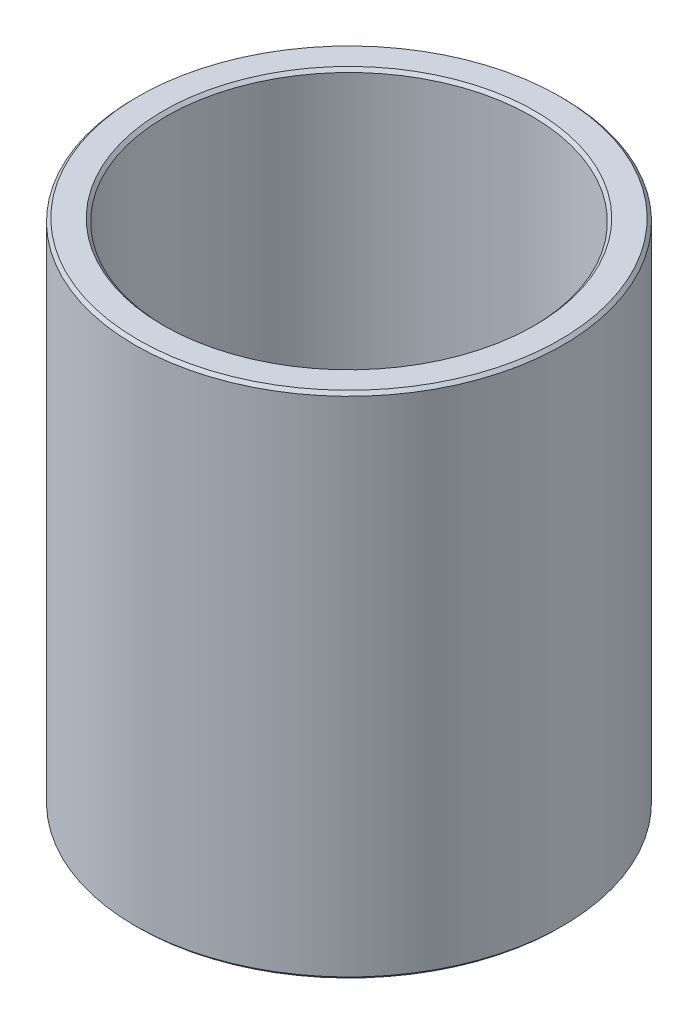
ISO-10303-21;
HEADER;
FILE_DESCRIPTION(('STEP AP214'),'2;1');
FILE_NAME('part.step','',(''),(''),'','','');
FILE_SCHEMA(('AUTOMOTIVE_DESIGN { 1 0 10303 214 1 1 1 1 }'));
ENDSEC;
DATA;
#1=APPLICATION_CONTEXT('core data for automotive mechanical design processes');
#2=APPLICATION_PROTOCOL_DEFINITION('international standard','automotive_design',2000,#1);
#3=PRODUCT_CONTEXT('',#1,'mechanical');
#4=PRODUCT('Part','Part','',(#3));
#5=PRODUCT_RELATED_PRODUCT_CATEGORY('part','',(#4));
#6=PRODUCT_DEFINITION_FORMATION('','',#4);
#7=PRODUCT_DEFINITION_CONTEXT('part definition',#1,'design');
#8=PRODUCT_DEFINITION('design','',#6,#7);
#9=PRODUCT_DEFINITION_SHAPE('','',#8);
#10=(LENGTH_UNIT() NAMED_UNIT(*) SI_UNIT(.MILLI.,.METRE.));
#11=(NAMED_UNIT(*) PLANE_ANGLE_UNIT() SI_UNIT($,.RADIAN.));
#12=(NAMED_UNIT(*) SI_UNIT($,.STERADIAN.) SOLID_ANGLE_UNIT());
#13=UNCERTAINTY_MEASURE_WITH_UNIT(LENGTH_MEASURE(1.E-05),#10,'distance_accuracy_value','');
#14=(GEOMETRIC_REPRESENTATION_CONTEXT(3) GLOBAL_UNCERTAINTY_ASSIGNED_CONTEXT((#13)) GLOBAL_UNIT_ASSIGNED_CONTEXT((#10,
#11,#12)) REPRESENTATION_CONTEXT('',''));
#15=CARTESIAN_POINT('',(0.,0.,0.));
#16=DIRECTION('',(0.,0.,1.));
#17=DIRECTION('',(1.,0.,0.));
#18=AXIS2_PLACEMENT_3D('',#15,#16,#17);
#19=CARTESIAN_POINT('',(0.,95.1754124637759,0.));
#20=DIRECTION('',(0.,-1.,0.));
#21=DIRECTION('',(0.,0.,-1.));
#22=AXIS2_PLACEMENT_3D('',#19,#20,#21);
#23=CYLINDRICAL_SURFACE('',#22,40.);
#24=CARTESIAN_POINT('',(0.,0.574226103046166,0.));
#25=DIRECTION('',(0.,1.,0.));
#26=DIRECTION('',(0.,0.,1.));
#27=AXIS2_PLACEMENT_3D('',#24,#25,#26);
#28=CIRCLE('',#27,40.);
#29=CARTESIAN_POINT('',(0.,0.574226103046166,40.));
#30=VERTEX_POINT('',#29);
#31=EDGE_CURVE('E10',#30,#30,#28,.T.);
#32=ORIENTED_EDGE('',*,*,#31,.T.);
#33=EDGE_LOOP('',(#32));
#34=FACE_BOUND('',#33,.T.);
#35=CARTESIAN_POINT('',(0.,94.6011863607297,0.));
#36=DIRECTION('',(0.,1.,0.));
#37=DIRECTION('',(0.,0.,1.));
#38=AXIS2_PLACEMENT_3D('',#35,#36,#37);
#39=CIRCLE('',#38,40.);
#40=CARTESIAN_POINT('',(0.,94.6011863607297,40.));
#41=VERTEX_POINT('',#40);
#42=EDGE_CURVE('E50',#41,#41,#39,.F.);
#43=ORIENTED_EDGE('',*,*,#42,.T.);
#44=EDGE_LOOP('',(#43));
#45=FACE_BOUND('',#44,.T.);
#46=ADVANCED_FACE('F39',(#34,#45),#23,.T.);
#47=CARTESIAN_POINT('',(0.,95.1754124637759,0.));
#48=DIRECTION('',(0.,1.,0.));
#49=DIRECTION('',(0.,0.,1.));
#50=AXIS2_PLACEMENT_3D('',#47,#48,#49);
#51=PLANE('',#50);
#52=CARTESIAN_POINT('',(0.,95.1754124637759,0.));
#53=DIRECTION('',(0.,1.,0.));
#54=DIRECTION('',(0.,0.,1.));
#55=AXIS2_PLACEMENT_3D('',#52,#53,#54);
#56=CIRCLE('',#55,34.743220194475);
#57=CARTESIAN_POINT('',(0.,95.1754124637759,34.743220194475));
#58=VERTEX_POINT('',#57);
#59=EDGE_CURVE('E58',#58,#58,#56,.F.);
#60=ORIENTED_EDGE('',*,*,#59,.T.);
#61=EDGE_LOOP('',(#60));
#62=FACE_BOUND('',#61,.T.);
#63=CARTESIAN_POINT('',(0.,95.1754124637759,0.));
#64=DIRECTION('',(0.,1.,0.));
#65=DIRECTION('',(0.,0.,1.));
#66=AXIS2_PLACEMENT_3D('',#63,#64,#65);
#67=CIRCLE('',#66,39.4257738969538);
#68=CARTESIAN_POINT('',(0.,95.1754124637759,39.4257738969538));
#69=VERTEX_POINT('',#68);
#70=EDGE_CURVE('E61',#69,#69,#67,.T.);
#71=ORIENTED_EDGE('',*,*,#70,.T.);
#72=EDGE_LOOP('',(#71));
#73=FACE_BOUND('',#72,.T.);
#74=ADVANCED_FACE('F88',(#62,#73),#51,.T.);
#75=CARTESIAN_POINT('',(0.,0.,0.));
#76=DIRECTION('',(0.,1.,0.));
#77=DIRECTION('',(0.,0.,1.));
#78=AXIS2_PLACEMENT_3D('',#75,#76,#77);
#79=PLANE('',#78);
#80=CARTESIAN_POINT('',(0.,0.,0.));
#81=DIRECTION('',(0.,1.,0.));
#82=DIRECTION('',(0.,0.,1.));
#83=AXIS2_PLACEMENT_3D('',#80,#81,#82);
#84=CIRCLE('',#83,34.743220194475);
#85=CARTESIAN_POINT('',(0.,0.,34.743220194475));
#86=VERTEX_POINT('',#85);
#87=EDGE_CURVE('E51',#86,#86,#84,.T.);
#88=ORIENTED_EDGE('',*,*,#87,.T.);
#89=EDGE_LOOP('',(#88));
#90=FACE_BOUND('',#89,.T.);
#91=CARTESIAN_POINT('',(0.,0.,0.));
#92=DIRECTION('',(0.,1.,0.));
#93=DIRECTION('',(0.,0.,1.));
#94=AXIS2_PLACEMENT_3D('',#91,#92,#93);
#95=CIRCLE('',#94,39.4257738969539);
#96=CARTESIAN_POINT('',(0.,0.,39.4257738969539));
#97=VERTEX_POINT('',#96);
#98=EDGE_CURVE('E54',#97,#97,#95,.F.);
#99=ORIENTED_EDGE('',*,*,#98,.T.);
#100=EDGE_LOOP('',(#99));
#101=FACE_BOUND('',#100,.T.);
#102=ADVANCED_FACE('F83',(#90,#101),#79,.F.);
#103=CARTESIAN_POINT('',(0.,95.1754124637759,0.));
#104=DIRECTION('',(0.,-1.,0.));
#105=DIRECTION('',(0.,0.,-1.));
#106=AXIS2_PLACEMENT_3D('',#103,#104,#105);
#107=CYLINDRICAL_SURFACE('',#106,34.1689940914288);
#108=CARTESIAN_POINT('',(0.,94.6011863607297,0.));
#109=DIRECTION('',(0.,1.,0.));
#110=DIRECTION('',(0.,0.,1.));
#111=AXIS2_PLACEMENT_3D('',#108,#109,#110);
#112=CIRCLE('',#111,34.1689940914288);
#113=CARTESIAN_POINT('',(0.,94.6011863607297,34.1689940914288));
#114=VERTEX_POINT('',#113);
#115=EDGE_CURVE('E67',#114,#114,#112,.T.);
#116=ORIENTED_EDGE('',*,*,#115,.T.);
#117=EDGE_LOOP('',(#116));
#118=FACE_BOUND('',#117,.T.);
#119=CARTESIAN_POINT('',(0.,0.574226103046166,0.));
#120=DIRECTION('',(0.,1.,0.));
#121=DIRECTION('',(0.,0.,1.));
#122=AXIS2_PLACEMENT_3D('',#119,#120,#121);
#123=CIRCLE('',#122,34.1689940914288);
#124=CARTESIAN_POINT('',(0.,0.574226103046166,34.1689940914288));
#125=VERTEX_POINT('',#124);
#126=EDGE_CURVE('E69',#125,#125,#123,.F.);
#127=ORIENTED_EDGE('',*,*,#126,.T.);
#128=EDGE_LOOP('',(#127));
#129=FACE_BOUND('',#128,.T.);
#130=ADVANCED_FACE('F71',(#118,#129),#107,.F.);
#131=CARTESIAN_POINT('',(0.,94.6011863607297,0.));
#132=DIRECTION('',(0.,1.,0.));
#133=DIRECTION('',(0.,0.,1.));
#134=AXIS2_PLACEMENT_3D('',#131,#132,#133);
#135=CONICAL_SURFACE('',#134,34.1689940914288,0.785398163397448);
#136=ORIENTED_EDGE('',*,*,#59,.F.);
#137=EDGE_LOOP('',(#136));
#138=FACE_BOUND('',#137,.T.);
#139=ORIENTED_EDGE('',*,*,#115,.F.);
#140=EDGE_LOOP('',(#139));
#141=FACE_BOUND('',#140,.T.);
#142=ADVANCED_FACE('F77',(#138,#141),#135,.F.);
#143=CARTESIAN_POINT('',(0.,0.,0.));
#144=DIRECTION('',(0.,-1.,0.));
#145=DIRECTION('',(0.,0.,-1.));
#146=AXIS2_PLACEMENT_3D('',#143,#144,#145);
#147=CONICAL_SURFACE('',#146,34.743220194475,0.785398163397448);
#148=ORIENTED_EDGE('',*,*,#126,.F.);
#149=EDGE_LOOP('',(#148));
#150=FACE_BOUND('',#149,.T.);
#151=ORIENTED_EDGE('',*,*,#87,.F.);
#152=EDGE_LOOP('',(#151));
#153=FACE_BOUND('',#152,.T.);
#154=ADVANCED_FACE('F73',(#150,#153),#147,.F.);
#155=CARTESIAN_POINT('',(0.,0.574226103046166,0.));
#156=DIRECTION('',(0.,1.,0.));
#157=DIRECTION('',(0.,0.,1.));
#158=AXIS2_PLACEMENT_3D('',#155,#156,#157);
#159=CONICAL_SURFACE('',#158,40.,0.78539816339743);
#160=ORIENTED_EDGE('',*,*,#98,.F.);
#161=EDGE_LOOP('',(#160));
#162=FACE_BOUND('',#161,.T.);
#163=ORIENTED_EDGE('',*,*,#31,.F.);
#164=EDGE_LOOP('',(#163));
#165=FACE_BOUND('',#164,.T.);
#166=ADVANCED_FACE('F76',(#162,#165),#159,.T.);
#167=CARTESIAN_POINT('',(0.,95.1754124637759,0.));
#168=DIRECTION('',(0.,-1.,0.));
#169=DIRECTION('',(0.,0.,-1.));
#170=AXIS2_PLACEMENT_3D('',#167,#168,#169);
#171=CONICAL_SURFACE('',#170,39.4257738969538,0.785398163397442);
#172=ORIENTED_EDGE('',*,*,#42,.F.);
#173=EDGE_LOOP('',(#172));
#174=FACE_BOUND('',#173,.T.);
#175=ORIENTED_EDGE('',*,*,#70,.F.);
#176=EDGE_LOOP('',(#175));
#177=FACE_BOUND('',#176,.T.);
#178=ADVANCED_FACE('F45',(#174,#177),#171,.T.);
#179=CLOSED_SHELL('',(#46,#74,#102,#130,#142,#154,#166,#178));
#180=MANIFOLD_SOLID_BREP('B2',#179);
#181=ADVANCED_BREP_SHAPE_REPRESENTATION('',(#18,#180),#14);
#182=SHAPE_DEFINITION_REPRESENTATION(#9,#181);
ENDSEC;
END-ISO-10303-21;
